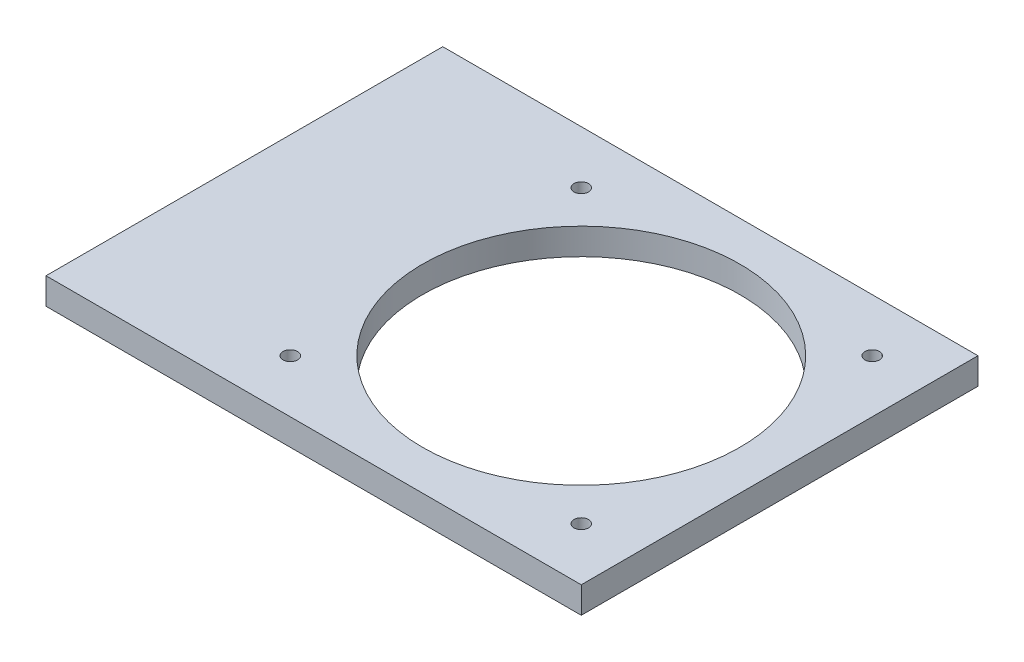
ISO-10303-21;
HEADER;
FILE_DESCRIPTION(('STEP AP214'),'2;1');
FILE_NAME('part.step','',(''),(''),'','','');
FILE_SCHEMA(('AUTOMOTIVE_DESIGN { 1 0 10303 214 1 1 1 1 }'));
ENDSEC;
DATA;
#1=APPLICATION_CONTEXT('core data for automotive mechanical design processes');
#2=APPLICATION_PROTOCOL_DEFINITION('international standard','automotive_design',2000,#1);
#3=PRODUCT_CONTEXT('',#1,'mechanical');
#4=PRODUCT('Part','Part','',(#3));
#5=PRODUCT_RELATED_PRODUCT_CATEGORY('part','',(#4));
#6=PRODUCT_DEFINITION_FORMATION('','',#4);
#7=PRODUCT_DEFINITION_CONTEXT('part definition',#1,'design');
#8=PRODUCT_DEFINITION('design','',#6,#7);
#9=PRODUCT_DEFINITION_SHAPE('','',#8);
#10=(LENGTH_UNIT() NAMED_UNIT(*) SI_UNIT(.MILLI.,.METRE.));
#11=(NAMED_UNIT(*) PLANE_ANGLE_UNIT() SI_UNIT($,.RADIAN.));
#12=(NAMED_UNIT(*) SI_UNIT($,.STERADIAN.) SOLID_ANGLE_UNIT());
#13=UNCERTAINTY_MEASURE_WITH_UNIT(LENGTH_MEASURE(1.E-05),#10,'distance_accuracy_value','');
#14=(GEOMETRIC_REPRESENTATION_CONTEXT(3) GLOBAL_UNCERTAINTY_ASSIGNED_CONTEXT((#13)) GLOBAL_UNIT_ASSIGNED_CONTEXT((#10,
#11,#12)) REPRESENTATION_CONTEXT('',''));
#15=CARTESIAN_POINT('',(0.,0.,0.));
#16=DIRECTION('',(0.,0.,1.));
#17=DIRECTION('',(1.,0.,0.));
#18=AXIS2_PLACEMENT_3D('',#15,#16,#17);
#19=CARTESIAN_POINT('',(155.722607748748,304.8,95.25));
#20=DIRECTION('',(-1.,0.,0.));
#21=DIRECTION('',(0.,0.,1.));
#22=AXIS2_PLACEMENT_3D('',#19,#20,#21);
#23=PLANE('',#22);
#24=DIRECTION('',(0.,1.,0.));
#25=VECTOR('',#24,1.);
#26=CARTESIAN_POINT('',(155.722607748748,304.8,0.));
#27=LINE('',#26,#25);
#28=CARTESIAN_POINT('',(155.722607748748,304.8,0.));
#29=VERTEX_POINT('',#28);
#30=CARTESIAN_POINT('',(155.722607748748,311.15,0.));
#31=VERTEX_POINT('',#30);
#32=EDGE_CURVE('E96',#29,#31,#27,.T.);
#33=ORIENTED_EDGE('',*,*,#32,.T.);
#34=DIRECTION('',(0.,0.,-1.));
#35=VECTOR('',#34,1.);
#36=CARTESIAN_POINT('',(155.722607748748,311.15,95.25));
#37=LINE('',#36,#35);
#38=CARTESIAN_POINT('',(155.722607748748,311.15,95.25));
#39=VERTEX_POINT('',#38);
#40=EDGE_CURVE('E11',#39,#31,#37,.T.);
#41=ORIENTED_EDGE('',*,*,#40,.F.);
#42=DIRECTION('',(0.,1.,0.));
#43=VECTOR('',#42,1.);
#44=CARTESIAN_POINT('',(155.722607748748,304.8,95.25));
#45=LINE('',#44,#43);
#46=CARTESIAN_POINT('',(155.722607748748,304.8,95.25));
#47=VERTEX_POINT('',#46);
#48=EDGE_CURVE('E84',#47,#39,#45,.T.);
#49=ORIENTED_EDGE('',*,*,#48,.F.);
#50=DIRECTION('',(0.,0.,-1.));
#51=VECTOR('',#50,1.);
#52=CARTESIAN_POINT('',(155.722607748748,304.8,95.25));
#53=LINE('',#52,#51);
#54=EDGE_CURVE('E92',#47,#29,#53,.T.);
#55=ORIENTED_EDGE('',*,*,#54,.T.);
#56=EDGE_LOOP('',(#33,#41,#49,#55));
#57=FACE_BOUND('',#56,.T.);
#58=ADVANCED_FACE('F33',(#57),#23,.F.);
#59=CARTESIAN_POINT('',(155.722607748748,311.15,95.25));
#60=DIRECTION('',(0.,-1.,0.));
#61=DIRECTION('',(0.,0.,-1.));
#62=AXIS2_PLACEMENT_3D('',#59,#60,#61);
#63=PLANE('',#62);
#64=CARTESIAN_POINT('',(143.022607748748,311.15,12.7));
#65=DIRECTION('',(0.,1.,0.));
#66=DIRECTION('',(0.,0.,1.));
#67=AXIS2_PLACEMENT_3D('',#64,#65,#66);
#68=CIRCLE('',#67,1.75000000000001);
#69=CARTESIAN_POINT('',(143.022607748748,311.15,14.45));
#70=VERTEX_POINT('',#69);
#71=EDGE_CURVE('E134',#70,#70,#68,.T.);
#72=ORIENTED_EDGE('',*,*,#71,.F.);
#73=EDGE_LOOP('',(#72));
#74=FACE_BOUND('',#73,.T.);
#75=CARTESIAN_POINT('',(143.022607748748,311.15,82.55));
#76=DIRECTION('',(0.,1.,0.));
#77=DIRECTION('',(0.,0.,1.));
#78=AXIS2_PLACEMENT_3D('',#75,#76,#77);
#79=CIRCLE('',#78,1.75000000000001);
#80=CARTESIAN_POINT('',(143.022607748748,311.15,84.3));
#81=VERTEX_POINT('',#80);
#82=EDGE_CURVE('E128',#81,#81,#79,.T.);
#83=ORIENTED_EDGE('',*,*,#82,.F.);
#84=EDGE_LOOP('',(#83));
#85=FACE_BOUND('',#84,.T.);
#86=CARTESIAN_POINT('',(73.1726077487481,311.15,82.55));
#87=DIRECTION('',(0.,1.,0.));
#88=DIRECTION('',(0.,0.,1.));
#89=AXIS2_PLACEMENT_3D('',#86,#87,#88);
#90=CIRCLE('',#89,1.75);
#91=CARTESIAN_POINT('',(73.1726077487481,311.15,84.3));
#92=VERTEX_POINT('',#91);
#93=EDGE_CURVE('E122',#92,#92,#90,.T.);
#94=ORIENTED_EDGE('',*,*,#93,.F.);
#95=EDGE_LOOP('',(#94));
#96=FACE_BOUND('',#95,.T.);
#97=CARTESIAN_POINT('',(73.1726077487481,311.15,12.7));
#98=DIRECTION('',(0.,1.,0.));
#99=DIRECTION('',(0.,0.,1.));
#100=AXIS2_PLACEMENT_3D('',#97,#98,#99);
#101=CIRCLE('',#100,1.75);
#102=CARTESIAN_POINT('',(73.1726077487481,311.15,14.45));
#103=VERTEX_POINT('',#102);
#104=EDGE_CURVE('E116',#103,#103,#101,.T.);
#105=ORIENTED_EDGE('',*,*,#104,.F.);
#106=EDGE_LOOP('',(#105));
#107=FACE_BOUND('',#106,.T.);
#108=CARTESIAN_POINT('',(108.097607748748,311.15,47.625));
#109=DIRECTION('',(0.,1.,0.));
#110=DIRECTION('',(0.,0.,1.));
#111=AXIS2_PLACEMENT_3D('',#108,#109,#110);
#112=CIRCLE('',#111,38.1);
#113=CARTESIAN_POINT('',(108.097607748748,311.15,85.725));
#114=VERTEX_POINT('',#113);
#115=EDGE_CURVE('E110',#114,#114,#112,.T.);
#116=ORIENTED_EDGE('',*,*,#115,.F.);
#117=EDGE_LOOP('',(#116));
#118=FACE_BOUND('',#117,.T.);
#119=DIRECTION('',(-1.,0.,0.));
#120=VECTOR('',#119,1.);
#121=CARTESIAN_POINT('',(155.722607748748,311.15,0.));
#122=LINE('',#121,#120);
#123=CARTESIAN_POINT('',(27.2220976560924,311.15,0.));
#124=VERTEX_POINT('',#123);
#125=EDGE_CURVE('E88',#31,#124,#122,.T.);
#126=ORIENTED_EDGE('',*,*,#125,.T.);
#127=DIRECTION('',(0.,0.,-1.));
#128=VECTOR('',#127,1.);
#129=CARTESIAN_POINT('',(27.2220976560924,311.15,95.25));
#130=LINE('',#129,#128);
#131=CARTESIAN_POINT('',(27.2220976560924,311.15,95.25));
#132=VERTEX_POINT('',#131);
#133=EDGE_CURVE('E41',#132,#124,#130,.T.);
#134=ORIENTED_EDGE('',*,*,#133,.F.);
#135=DIRECTION('',(-1.,0.,0.));
#136=VECTOR('',#135,1.);
#137=CARTESIAN_POINT('',(155.722607748748,311.15,95.25));
#138=LINE('',#137,#136);
#139=EDGE_CURVE('E79',#39,#132,#138,.T.);
#140=ORIENTED_EDGE('',*,*,#139,.F.);
#141=ORIENTED_EDGE('',*,*,#40,.T.);
#142=EDGE_LOOP('',(#126,#134,#140,#141));
#143=FACE_BOUND('',#142,.T.);
#144=ADVANCED_FACE('F87',(#74,#85,#96,#107,#118,#143),#63,.F.);
#145=CARTESIAN_POINT('',(27.2220976560924,304.8,95.25));
#146=DIRECTION('',(1.,0.,0.));
#147=DIRECTION('',(0.,1.,0.));
#148=AXIS2_PLACEMENT_3D('',#145,#146,#147);
#149=PLANE('',#148);
#150=DIRECTION('',(0.,-1.,0.));
#151=VECTOR('',#150,1.);
#152=CARTESIAN_POINT('',(27.2220976560924,304.8,0.));
#153=LINE('',#152,#151);
#154=CARTESIAN_POINT('',(27.2220976560924,304.8,0.));
#155=VERTEX_POINT('',#154);
#156=EDGE_CURVE('E66',#124,#155,#153,.T.);
#157=ORIENTED_EDGE('',*,*,#156,.T.);
#158=DIRECTION('',(0.,0.,-1.));
#159=VECTOR('',#158,1.);
#160=CARTESIAN_POINT('',(27.2220976560924,304.8,95.25));
#161=LINE('',#160,#159);
#162=CARTESIAN_POINT('',(27.2220976560924,304.8,95.25));
#163=VERTEX_POINT('',#162);
#164=EDGE_CURVE('E89',#163,#155,#161,.T.);
#165=ORIENTED_EDGE('',*,*,#164,.F.);
#166=DIRECTION('',(0.,-1.,0.));
#167=VECTOR('',#166,1.);
#168=CARTESIAN_POINT('',(27.2220976560924,304.8,95.25));
#169=LINE('',#168,#167);
#170=EDGE_CURVE('E82',#132,#163,#169,.T.);
#171=ORIENTED_EDGE('',*,*,#170,.F.);
#172=ORIENTED_EDGE('',*,*,#133,.T.);
#173=EDGE_LOOP('',(#157,#165,#171,#172));
#174=FACE_BOUND('',#173,.T.);
#175=ADVANCED_FACE('F90',(#174),#149,.F.);
#176=CARTESIAN_POINT('',(155.722607748748,304.8,95.25));
#177=DIRECTION('',(0.,1.,0.));
#178=DIRECTION('',(0.,0.,1.));
#179=AXIS2_PLACEMENT_3D('',#176,#177,#178);
#180=PLANE('',#179);
#181=CARTESIAN_POINT('',(143.022607748748,304.8,12.7));
#182=DIRECTION('',(0.,1.,0.));
#183=DIRECTION('',(0.,0.,1.));
#184=AXIS2_PLACEMENT_3D('',#181,#182,#183);
#185=CIRCLE('',#184,1.75000000000001);
#186=CARTESIAN_POINT('',(143.022607748748,304.8,14.45));
#187=VERTEX_POINT('',#186);
#188=EDGE_CURVE('E131',#187,#187,#185,.T.);
#189=ORIENTED_EDGE('',*,*,#188,.T.);
#190=EDGE_LOOP('',(#189));
#191=FACE_BOUND('',#190,.T.);
#192=CARTESIAN_POINT('',(143.022607748748,304.8,82.55));
#193=DIRECTION('',(0.,1.,0.));
#194=DIRECTION('',(0.,0.,1.));
#195=AXIS2_PLACEMENT_3D('',#192,#193,#194);
#196=CIRCLE('',#195,1.75000000000001);
#197=CARTESIAN_POINT('',(143.022607748748,304.8,84.3));
#198=VERTEX_POINT('',#197);
#199=EDGE_CURVE('E125',#198,#198,#196,.T.);
#200=ORIENTED_EDGE('',*,*,#199,.T.);
#201=EDGE_LOOP('',(#200));
#202=FACE_BOUND('',#201,.T.);
#203=CARTESIAN_POINT('',(73.1726077487481,304.8,82.55));
#204=DIRECTION('',(0.,1.,0.));
#205=DIRECTION('',(0.,0.,1.));
#206=AXIS2_PLACEMENT_3D('',#203,#204,#205);
#207=CIRCLE('',#206,1.75);
#208=CARTESIAN_POINT('',(73.1726077487481,304.8,84.3));
#209=VERTEX_POINT('',#208);
#210=EDGE_CURVE('E119',#209,#209,#207,.T.);
#211=ORIENTED_EDGE('',*,*,#210,.T.);
#212=EDGE_LOOP('',(#211));
#213=FACE_BOUND('',#212,.T.);
#214=CARTESIAN_POINT('',(73.1726077487481,304.8,12.7));
#215=DIRECTION('',(0.,1.,0.));
#216=DIRECTION('',(0.,0.,1.));
#217=AXIS2_PLACEMENT_3D('',#214,#215,#216);
#218=CIRCLE('',#217,1.75);
#219=CARTESIAN_POINT('',(73.1726077487481,304.8,14.45));
#220=VERTEX_POINT('',#219);
#221=EDGE_CURVE('E113',#220,#220,#218,.T.);
#222=ORIENTED_EDGE('',*,*,#221,.T.);
#223=EDGE_LOOP('',(#222));
#224=FACE_BOUND('',#223,.T.);
#225=CARTESIAN_POINT('',(108.097607748748,304.8,47.625));
#226=DIRECTION('',(0.,1.,0.));
#227=DIRECTION('',(0.,0.,1.));
#228=AXIS2_PLACEMENT_3D('',#225,#226,#227);
#229=CIRCLE('',#228,38.1);
#230=CARTESIAN_POINT('',(108.097607748748,304.8,85.725));
#231=VERTEX_POINT('',#230);
#232=EDGE_CURVE('E99',#231,#231,#229,.T.);
#233=ORIENTED_EDGE('',*,*,#232,.T.);
#234=EDGE_LOOP('',(#233));
#235=FACE_BOUND('',#234,.T.);
#236=DIRECTION('',(1.,0.,0.));
#237=VECTOR('',#236,1.);
#238=CARTESIAN_POINT('',(155.722607748748,304.8,0.));
#239=LINE('',#238,#237);
#240=EDGE_CURVE('E72',#155,#29,#239,.T.);
#241=ORIENTED_EDGE('',*,*,#240,.T.);
#242=ORIENTED_EDGE('',*,*,#54,.F.);
#243=DIRECTION('',(1.,0.,0.));
#244=VECTOR('',#243,1.);
#245=CARTESIAN_POINT('',(155.722607748748,304.8,95.25));
#246=LINE('',#245,#244);
#247=EDGE_CURVE('E49',#163,#47,#246,.T.);
#248=ORIENTED_EDGE('',*,*,#247,.F.);
#249=ORIENTED_EDGE('',*,*,#164,.T.);
#250=EDGE_LOOP('',(#241,#242,#248,#249));
#251=FACE_BOUND('',#250,.T.);
#252=ADVANCED_FACE('F104',(#191,#202,#213,#224,#235,#251),#180,.F.);
#253=CARTESIAN_POINT('',(0.,0.,95.25));
#254=DIRECTION('',(0.,0.,1.));
#255=DIRECTION('',(1.,0.,0.));
#256=AXIS2_PLACEMENT_3D('',#253,#254,#255);
#257=PLANE('',#256);
#258=ORIENTED_EDGE('',*,*,#48,.T.);
#259=ORIENTED_EDGE('',*,*,#139,.T.);
#260=ORIENTED_EDGE('',*,*,#170,.T.);
#261=ORIENTED_EDGE('',*,*,#247,.T.);
#262=EDGE_LOOP('',(#258,#259,#260,#261));
#263=FACE_BOUND('',#262,.T.);
#264=ADVANCED_FACE('F80',(#263),#257,.T.);
#265=CARTESIAN_POINT('',(0.,0.,0.));
#266=DIRECTION('',(0.,0.,1.));
#267=DIRECTION('',(1.,0.,0.));
#268=AXIS2_PLACEMENT_3D('',#265,#266,#267);
#269=PLANE('',#268);
#270=ORIENTED_EDGE('',*,*,#32,.F.);
#271=ORIENTED_EDGE('',*,*,#240,.F.);
#272=ORIENTED_EDGE('',*,*,#156,.F.);
#273=ORIENTED_EDGE('',*,*,#125,.F.);
#274=EDGE_LOOP('',(#270,#271,#272,#273));
#275=FACE_BOUND('',#274,.T.);
#276=ADVANCED_FACE('F107',(#275),#269,.F.);
#277=CARTESIAN_POINT('',(108.097607748748,304.8,47.625));
#278=DIRECTION('',(0.,1.,0.));
#279=DIRECTION('',(0.,0.,1.));
#280=AXIS2_PLACEMENT_3D('',#277,#278,#279);
#281=CYLINDRICAL_SURFACE('',#280,38.1);
#282=ORIENTED_EDGE('',*,*,#232,.F.);
#283=EDGE_LOOP('',(#282));
#284=FACE_BOUND('',#283,.T.);
#285=ORIENTED_EDGE('',*,*,#115,.T.);
#286=EDGE_LOOP('',(#285));
#287=FACE_BOUND('',#286,.T.);
#288=ADVANCED_FACE('F159',(#284,#287),#281,.F.);
#289=CARTESIAN_POINT('',(73.1726077487481,304.8,12.7));
#290=DIRECTION('',(0.,1.,0.));
#291=DIRECTION('',(0.,0.,1.));
#292=AXIS2_PLACEMENT_3D('',#289,#290,#291);
#293=CYLINDRICAL_SURFACE('',#292,1.75);
#294=ORIENTED_EDGE('',*,*,#221,.F.);
#295=EDGE_LOOP('',(#294));
#296=FACE_BOUND('',#295,.T.);
#297=ORIENTED_EDGE('',*,*,#104,.T.);
#298=EDGE_LOOP('',(#297));
#299=FACE_BOUND('',#298,.T.);
#300=ADVANCED_FACE('F161',(#296,#299),#293,.F.);
#301=CARTESIAN_POINT('',(73.1726077487481,304.8,82.55));
#302=DIRECTION('',(0.,1.,0.));
#303=DIRECTION('',(0.,0.,1.));
#304=AXIS2_PLACEMENT_3D('',#301,#302,#303);
#305=CYLINDRICAL_SURFACE('',#304,1.75);
#306=ORIENTED_EDGE('',*,*,#210,.F.);
#307=EDGE_LOOP('',(#306));
#308=FACE_BOUND('',#307,.T.);
#309=ORIENTED_EDGE('',*,*,#93,.T.);
#310=EDGE_LOOP('',(#309));
#311=FACE_BOUND('',#310,.T.);
#312=ADVANCED_FACE('F168',(#308,#311),#305,.F.);
#313=CARTESIAN_POINT('',(143.022607748748,304.8,82.55));
#314=DIRECTION('',(0.,1.,0.));
#315=DIRECTION('',(0.,0.,1.));
#316=AXIS2_PLACEMENT_3D('',#313,#314,#315);
#317=CYLINDRICAL_SURFACE('',#316,1.75000000000001);
#318=ORIENTED_EDGE('',*,*,#199,.F.);
#319=EDGE_LOOP('',(#318));
#320=FACE_BOUND('',#319,.T.);
#321=ORIENTED_EDGE('',*,*,#82,.T.);
#322=EDGE_LOOP('',(#321));
#323=FACE_BOUND('',#322,.T.);
#324=ADVANCED_FACE('F145',(#320,#323),#317,.F.);
#325=CARTESIAN_POINT('',(143.022607748748,304.8,12.7));
#326=DIRECTION('',(0.,1.,0.));
#327=DIRECTION('',(0.,0.,1.));
#328=AXIS2_PLACEMENT_3D('',#325,#326,#327);
#329=CYLINDRICAL_SURFACE('',#328,1.75000000000001);
#330=ORIENTED_EDGE('',*,*,#188,.F.);
#331=EDGE_LOOP('',(#330));
#332=FACE_BOUND('',#331,.T.);
#333=ORIENTED_EDGE('',*,*,#71,.T.);
#334=EDGE_LOOP('',(#333));
#335=FACE_BOUND('',#334,.T.);
#336=ADVANCED_FACE('F142',(#332,#335),#329,.F.);
#337=CLOSED_SHELL('',(#58,#144,#175,#252,#264,#276,#288,#300,#312,#324,#336));
#338=MANIFOLD_SOLID_BREP('B2',#337);
#339=ADVANCED_BREP_SHAPE_REPRESENTATION('',(#18,#338),#14);
#340=SHAPE_DEFINITION_REPRESENTATION(#9,#339);
ENDSEC;
END-ISO-10303-21;
